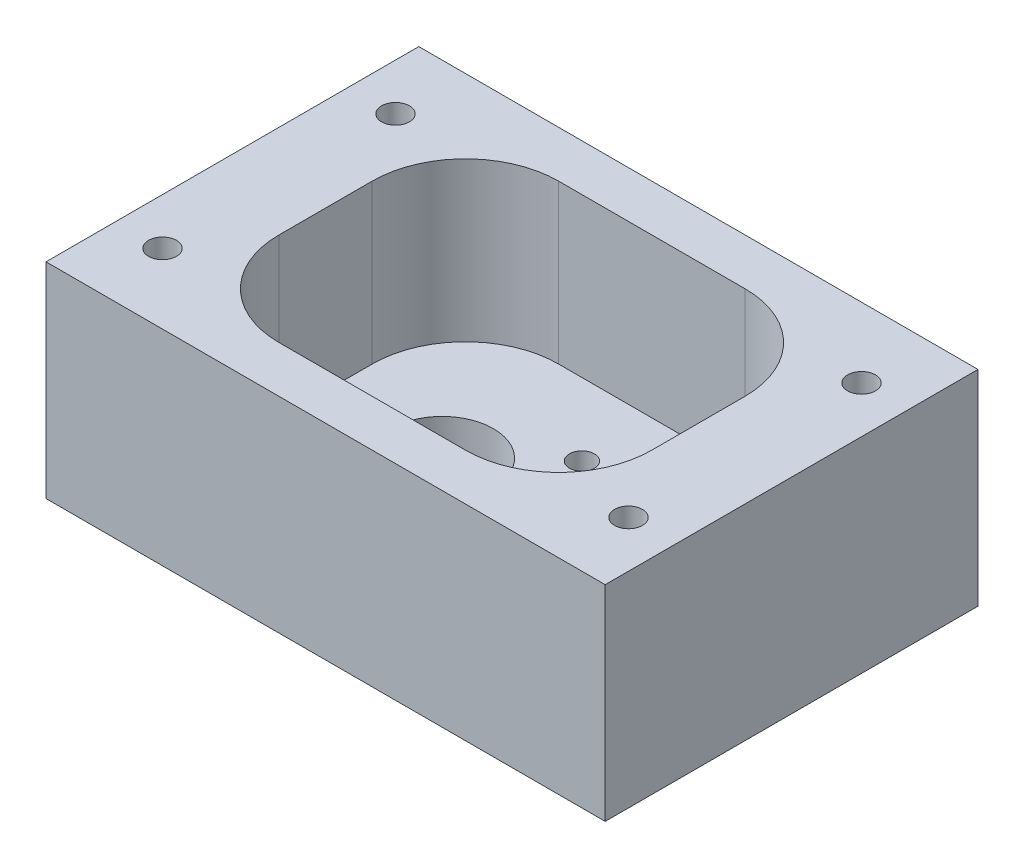
ISO-10303-21;
HEADER;
FILE_DESCRIPTION(('STEP AP214'),'2;1');
FILE_NAME('part.step','',(''),(''),'','','');
FILE_SCHEMA(('AUTOMOTIVE_DESIGN { 1 0 10303 214 1 1 1 1 }'));
ENDSEC;
DATA;
#1=APPLICATION_CONTEXT('core data for automotive mechanical design processes');
#2=APPLICATION_PROTOCOL_DEFINITION('international standard','automotive_design',2000,#1);
#3=PRODUCT_CONTEXT('',#1,'mechanical');
#4=PRODUCT('Part','Part','',(#3));
#5=PRODUCT_RELATED_PRODUCT_CATEGORY('part','',(#4));
#6=PRODUCT_DEFINITION_FORMATION('','',#4);
#7=PRODUCT_DEFINITION_CONTEXT('part definition',#1,'design');
#8=PRODUCT_DEFINITION('design','',#6,#7);
#9=PRODUCT_DEFINITION_SHAPE('','',#8);
#10=(LENGTH_UNIT() NAMED_UNIT(*) SI_UNIT(.MILLI.,.METRE.));
#11=(NAMED_UNIT(*) PLANE_ANGLE_UNIT() SI_UNIT($,.RADIAN.));
#12=(NAMED_UNIT(*) SI_UNIT($,.STERADIAN.) SOLID_ANGLE_UNIT());
#13=UNCERTAINTY_MEASURE_WITH_UNIT(LENGTH_MEASURE(1.E-05),#10,'distance_accuracy_value','');
#14=(GEOMETRIC_REPRESENTATION_CONTEXT(3) GLOBAL_UNCERTAINTY_ASSIGNED_CONTEXT((#13)) GLOBAL_UNIT_ASSIGNED_CONTEXT((#10,
#11,#12)) REPRESENTATION_CONTEXT('',''));
#15=CARTESIAN_POINT('',(0.,0.,0.));
#16=DIRECTION('',(0.,0.,1.));
#17=DIRECTION('',(1.,0.,0.));
#18=AXIS2_PLACEMENT_3D('',#15,#16,#17);
#19=CARTESIAN_POINT('',(38.1,27.94,25.4));
#20=DIRECTION('',(-1.,0.,0.));
#21=DIRECTION('',(0.,0.,1.));
#22=AXIS2_PLACEMENT_3D('',#19,#20,#21);
#23=PLANE('',#22);
#24=DIRECTION('',(0.,0.,-1.));
#25=VECTOR('',#24,1.);
#26=CARTESIAN_POINT('',(38.1,0.,25.4));
#27=LINE('',#26,#25);
#28=CARTESIAN_POINT('',(38.1,0.,25.4));
#29=VERTEX_POINT('',#28);
#30=CARTESIAN_POINT('',(38.1,0.,-25.4));
#31=VERTEX_POINT('',#30);
#32=EDGE_CURVE('E217',#29,#31,#27,.T.);
#33=ORIENTED_EDGE('',*,*,#32,.T.);
#34=DIRECTION('',(0.,-1.,0.));
#35=VECTOR('',#34,1.);
#36=CARTESIAN_POINT('',(38.1,27.94,-25.4));
#37=LINE('',#36,#35);
#38=CARTESIAN_POINT('',(38.1,27.94,-25.4));
#39=VERTEX_POINT('',#38);
#40=EDGE_CURVE('E11',#39,#31,#37,.T.);
#41=ORIENTED_EDGE('',*,*,#40,.F.);
#42=DIRECTION('',(0.,0.,-1.));
#43=VECTOR('',#42,1.);
#44=CARTESIAN_POINT('',(38.1,27.94,25.4));
#45=LINE('',#44,#43);
#46=CARTESIAN_POINT('',(38.1,27.94,25.4));
#47=VERTEX_POINT('',#46);
#48=EDGE_CURVE('E220',#47,#39,#45,.T.);
#49=ORIENTED_EDGE('',*,*,#48,.F.);
#50=DIRECTION('',(0.,-1.,0.));
#51=VECTOR('',#50,1.);
#52=CARTESIAN_POINT('',(38.1,27.94,25.4));
#53=LINE('',#52,#51);
#54=EDGE_CURVE('E226',#47,#29,#53,.T.);
#55=ORIENTED_EDGE('',*,*,#54,.T.);
#56=EDGE_LOOP('',(#33,#41,#49,#55));
#57=FACE_BOUND('',#56,.T.);
#58=ADVANCED_FACE('F35',(#57),#23,.F.);
#59=CARTESIAN_POINT('',(-38.1,27.94,-25.4));
#60=DIRECTION('',(0.,0.,1.));
#61=DIRECTION('',(1.,0.,0.));
#62=AXIS2_PLACEMENT_3D('',#59,#60,#61);
#63=PLANE('',#62);
#64=DIRECTION('',(-1.,0.,0.));
#65=VECTOR('',#64,1.);
#66=CARTESIAN_POINT('',(-38.1,0.,-25.4));
#67=LINE('',#66,#65);
#68=CARTESIAN_POINT('',(-38.1,0.,-25.4));
#69=VERTEX_POINT('',#68);
#70=EDGE_CURVE('E229',#31,#69,#67,.T.);
#71=ORIENTED_EDGE('',*,*,#70,.T.);
#72=DIRECTION('',(0.,-1.,0.));
#73=VECTOR('',#72,1.);
#74=CARTESIAN_POINT('',(-38.1,27.94,-25.4));
#75=LINE('',#74,#73);
#76=CARTESIAN_POINT('',(-38.1,27.94,-25.4));
#77=VERTEX_POINT('',#76);
#78=EDGE_CURVE('E43',#77,#69,#75,.T.);
#79=ORIENTED_EDGE('',*,*,#78,.F.);
#80=DIRECTION('',(-1.,0.,0.));
#81=VECTOR('',#80,1.);
#82=CARTESIAN_POINT('',(-38.1,27.94,-25.4));
#83=LINE('',#82,#81);
#84=EDGE_CURVE('E88',#39,#77,#83,.T.);
#85=ORIENTED_EDGE('',*,*,#84,.F.);
#86=ORIENTED_EDGE('',*,*,#40,.T.);
#87=EDGE_LOOP('',(#71,#79,#85,#86));
#88=FACE_BOUND('',#87,.T.);
#89=ADVANCED_FACE('F322',(#88),#63,.F.);
#90=CARTESIAN_POINT('',(-38.1,27.94,25.4));
#91=DIRECTION('',(1.,0.,0.));
#92=DIRECTION('',(0.,0.,-1.));
#93=AXIS2_PLACEMENT_3D('',#90,#91,#92);
#94=PLANE('',#93);
#95=DIRECTION('',(0.,0.,1.));
#96=VECTOR('',#95,1.);
#97=CARTESIAN_POINT('',(-38.1,0.,25.4));
#98=LINE('',#97,#96);
#99=CARTESIAN_POINT('',(-38.1,0.,25.4));
#100=VERTEX_POINT('',#99);
#101=EDGE_CURVE('E231',#69,#100,#98,.T.);
#102=ORIENTED_EDGE('',*,*,#101,.T.);
#103=DIRECTION('',(0.,-1.,0.));
#104=VECTOR('',#103,1.);
#105=CARTESIAN_POINT('',(-38.1,27.94,25.4));
#106=LINE('',#105,#104);
#107=CARTESIAN_POINT('',(-38.1,27.94,25.4));
#108=VERTEX_POINT('',#107);
#109=EDGE_CURVE('E235',#108,#100,#106,.T.);
#110=ORIENTED_EDGE('',*,*,#109,.F.);
#111=DIRECTION('',(0.,0.,1.));
#112=VECTOR('',#111,1.);
#113=CARTESIAN_POINT('',(-38.1,27.94,25.4));
#114=LINE('',#113,#112);
#115=EDGE_CURVE('E223',#77,#108,#114,.T.);
#116=ORIENTED_EDGE('',*,*,#115,.F.);
#117=ORIENTED_EDGE('',*,*,#78,.T.);
#118=EDGE_LOOP('',(#102,#110,#116,#117));
#119=FACE_BOUND('',#118,.T.);
#120=ADVANCED_FACE('F321',(#119),#94,.F.);
#121=CARTESIAN_POINT('',(-38.1,27.94,25.4));
#122=DIRECTION('',(0.,0.,-1.));
#123=DIRECTION('',(-1.,0.,0.));
#124=AXIS2_PLACEMENT_3D('',#121,#122,#123);
#125=PLANE('',#124);
#126=DIRECTION('',(1.,0.,0.));
#127=VECTOR('',#126,1.);
#128=CARTESIAN_POINT('',(-38.1,0.,25.4));
#129=LINE('',#128,#127);
#130=EDGE_CURVE('E81',#100,#29,#129,.T.);
#131=ORIENTED_EDGE('',*,*,#130,.T.);
#132=ORIENTED_EDGE('',*,*,#54,.F.);
#133=DIRECTION('',(1.,0.,0.));
#134=VECTOR('',#133,1.);
#135=CARTESIAN_POINT('',(-38.1,27.94,25.4));
#136=LINE('',#135,#134);
#137=EDGE_CURVE('E60',#108,#47,#136,.T.);
#138=ORIENTED_EDGE('',*,*,#137,.F.);
#139=ORIENTED_EDGE('',*,*,#109,.T.);
#140=EDGE_LOOP('',(#131,#132,#138,#139));
#141=FACE_BOUND('',#140,.T.);
#142=ADVANCED_FACE('F317',(#141),#125,.F.);
#143=CARTESIAN_POINT('',(0.,27.94,0.));
#144=DIRECTION('',(0.,-1.,0.));
#145=DIRECTION('',(0.,0.,-1.));
#146=AXIS2_PLACEMENT_3D('',#143,#144,#145);
#147=PLANE('',#146);
#148=CARTESIAN_POINT('',(-31.75,27.94,15.875));
#149=DIRECTION('',(0.,-1.,0.));
#150=DIRECTION('',(0.,0.,-1.));
#151=AXIS2_PLACEMENT_3D('',#148,#149,#150);
#152=CIRCLE('',#151,1.89864999999999);
#153=CARTESIAN_POINT('',(-31.75,27.94,13.97635));
#154=VERTEX_POINT('',#153);
#155=EDGE_CURVE('E279',#154,#154,#152,.T.);
#156=ORIENTED_EDGE('',*,*,#155,.T.);
#157=EDGE_LOOP('',(#156));
#158=FACE_BOUND('',#157,.T.);
#159=CARTESIAN_POINT('',(-31.75,27.94,-15.875));
#160=DIRECTION('',(0.,-1.,0.));
#161=DIRECTION('',(0.,0.,-1.));
#162=AXIS2_PLACEMENT_3D('',#159,#160,#161);
#163=CIRCLE('',#162,1.89864999999999);
#164=CARTESIAN_POINT('',(-31.75,27.94,-17.77365));
#165=VERTEX_POINT('',#164);
#166=EDGE_CURVE('E273',#165,#165,#163,.T.);
#167=ORIENTED_EDGE('',*,*,#166,.T.);
#168=EDGE_LOOP('',(#167));
#169=FACE_BOUND('',#168,.T.);
#170=CARTESIAN_POINT('',(31.75,27.94,15.875));
#171=DIRECTION('',(0.,-1.,0.));
#172=DIRECTION('',(0.,0.,-1.));
#173=AXIS2_PLACEMENT_3D('',#170,#171,#172);
#174=CIRCLE('',#173,1.89864999999999);
#175=CARTESIAN_POINT('',(31.75,27.94,13.97635));
#176=VERTEX_POINT('',#175);
#177=EDGE_CURVE('E267',#176,#176,#174,.T.);
#178=ORIENTED_EDGE('',*,*,#177,.T.);
#179=EDGE_LOOP('',(#178));
#180=FACE_BOUND('',#179,.T.);
#181=CARTESIAN_POINT('',(31.75,27.94,-15.875));
#182=DIRECTION('',(0.,-1.,0.));
#183=DIRECTION('',(0.,0.,-1.));
#184=AXIS2_PLACEMENT_3D('',#181,#182,#183);
#185=CIRCLE('',#184,1.89864999999999);
#186=CARTESIAN_POINT('',(31.75,27.94,-17.77365));
#187=VERTEX_POINT('',#186);
#188=EDGE_CURVE('E261',#187,#187,#185,.T.);
#189=ORIENTED_EDGE('',*,*,#188,.T.);
#190=EDGE_LOOP('',(#189));
#191=FACE_BOUND('',#190,.T.);
#192=DIRECTION('',(-1.,0.,0.));
#193=VECTOR('',#192,1.);
#194=CARTESIAN_POINT('',(-12.7,27.94,-19.05));
#195=LINE('',#194,#193);
#196=CARTESIAN_POINT('',(12.7,27.94,-19.05));
#197=VERTEX_POINT('',#196);
#198=CARTESIAN_POINT('',(-12.7,27.94,-19.05));
#199=VERTEX_POINT('',#198);
#200=EDGE_CURVE('E179',#197,#199,#195,.T.);
#201=ORIENTED_EDGE('',*,*,#200,.F.);
#202=CARTESIAN_POINT('',(12.7,27.94,-6.34999999999999));
#203=DIRECTION('',(0.,1.,0.));
#204=DIRECTION('',(0.,0.,-1.));
#205=AXIS2_PLACEMENT_3D('',#202,#203,#204);
#206=CIRCLE('',#205,12.7);
#207=CARTESIAN_POINT('',(25.4,27.94,-6.34999999999999));
#208=VERTEX_POINT('',#207);
#209=EDGE_CURVE('E51',#208,#197,#206,.T.);
#210=ORIENTED_EDGE('',*,*,#209,.F.);
#211=DIRECTION('',(0.,0.,-1.));
#212=VECTOR('',#211,1.);
#213=CARTESIAN_POINT('',(25.4,27.94,6.35000000000001));
#214=LINE('',#213,#212);
#215=CARTESIAN_POINT('',(25.4,27.94,6.35000000000001));
#216=VERTEX_POINT('',#215);
#217=EDGE_CURVE('E156',#216,#208,#214,.T.);
#218=ORIENTED_EDGE('',*,*,#217,.F.);
#219=CARTESIAN_POINT('',(12.7,27.94,6.35000000000001));
#220=DIRECTION('',(0.,1.,0.));
#221=DIRECTION('',(0.,0.,-1.));
#222=AXIS2_PLACEMENT_3D('',#219,#220,#221);
#223=CIRCLE('',#222,12.7);
#224=CARTESIAN_POINT('',(12.7,27.94,19.05));
#225=VERTEX_POINT('',#224);
#226=EDGE_CURVE('E159',#225,#216,#223,.T.);
#227=ORIENTED_EDGE('',*,*,#226,.F.);
#228=DIRECTION('',(1.,0.,0.));
#229=VECTOR('',#228,1.);
#230=CARTESIAN_POINT('',(-12.7,27.94,19.05));
#231=LINE('',#230,#229);
#232=CARTESIAN_POINT('',(-12.7,27.94,19.05));
#233=VERTEX_POINT('',#232);
#234=EDGE_CURVE('E191',#233,#225,#231,.T.);
#235=ORIENTED_EDGE('',*,*,#234,.F.);
#236=CARTESIAN_POINT('',(-12.7,27.94,6.35000000000001));
#237=DIRECTION('',(0.,1.,0.));
#238=DIRECTION('',(0.,0.,-1.));
#239=AXIS2_PLACEMENT_3D('',#236,#237,#238);
#240=CIRCLE('',#239,12.7);
#241=CARTESIAN_POINT('',(-25.4,27.94,6.35000000000001));
#242=VERTEX_POINT('',#241);
#243=EDGE_CURVE('E188',#242,#233,#240,.T.);
#244=ORIENTED_EDGE('',*,*,#243,.F.);
#245=DIRECTION('',(0.,0.,1.));
#246=VECTOR('',#245,1.);
#247=CARTESIAN_POINT('',(-25.4,27.94,6.35000000000001));
#248=LINE('',#247,#246);
#249=CARTESIAN_POINT('',(-25.4,27.94,-6.34999999999999));
#250=VERTEX_POINT('',#249);
#251=EDGE_CURVE('E185',#250,#242,#248,.T.);
#252=ORIENTED_EDGE('',*,*,#251,.F.);
#253=CARTESIAN_POINT('',(-12.7,27.94,-6.34999999999999));
#254=DIRECTION('',(0.,1.,0.));
#255=DIRECTION('',(0.,0.,-1.));
#256=AXIS2_PLACEMENT_3D('',#253,#254,#255);
#257=CIRCLE('',#256,12.7);
#258=EDGE_CURVE('E182',#199,#250,#257,.T.);
#259=ORIENTED_EDGE('',*,*,#258,.F.);
#260=EDGE_LOOP('',(#201,#210,#218,#227,#235,#244,#252,#259));
#261=FACE_BOUND('',#260,.T.);
#262=ORIENTED_EDGE('',*,*,#48,.T.);
#263=ORIENTED_EDGE('',*,*,#84,.T.);
#264=ORIENTED_EDGE('',*,*,#115,.T.);
#265=ORIENTED_EDGE('',*,*,#137,.T.);
#266=EDGE_LOOP('',(#262,#263,#264,#265));
#267=FACE_BOUND('',#266,.T.);
#268=ADVANCED_FACE('F292',(#158,#169,#180,#191,#261,#267),#147,.F.);
#269=CARTESIAN_POINT('',(0.,0.,0.));
#270=DIRECTION('',(0.,-1.,0.));
#271=DIRECTION('',(0.,0.,-1.));
#272=AXIS2_PLACEMENT_3D('',#269,#270,#271);
#273=PLANE('',#272);
#274=CARTESIAN_POINT('',(-31.75,0.,15.875));
#275=DIRECTION('',(0.,-1.,0.));
#276=DIRECTION('',(0.,0.,-1.));
#277=AXIS2_PLACEMENT_3D('',#274,#275,#276);
#278=CIRCLE('',#277,1.89864999999999);
#279=CARTESIAN_POINT('',(-31.75,0.,13.97635));
#280=VERTEX_POINT('',#279);
#281=EDGE_CURVE('E282',#280,#280,#278,.T.);
#282=ORIENTED_EDGE('',*,*,#281,.F.);
#283=EDGE_LOOP('',(#282));
#284=FACE_BOUND('',#283,.T.);
#285=CARTESIAN_POINT('',(-31.75,0.,-15.875));
#286=DIRECTION('',(0.,-1.,0.));
#287=DIRECTION('',(0.,0.,-1.));
#288=AXIS2_PLACEMENT_3D('',#285,#286,#287);
#289=CIRCLE('',#288,1.89864999999999);
#290=CARTESIAN_POINT('',(-31.75,0.,-17.77365));
#291=VERTEX_POINT('',#290);
#292=EDGE_CURVE('E276',#291,#291,#289,.T.);
#293=ORIENTED_EDGE('',*,*,#292,.F.);
#294=EDGE_LOOP('',(#293));
#295=FACE_BOUND('',#294,.T.);
#296=CARTESIAN_POINT('',(31.75,0.,15.875));
#297=DIRECTION('',(0.,-1.,0.));
#298=DIRECTION('',(0.,0.,-1.));
#299=AXIS2_PLACEMENT_3D('',#296,#297,#298);
#300=CIRCLE('',#299,1.89864999999999);
#301=CARTESIAN_POINT('',(31.75,0.,13.97635));
#302=VERTEX_POINT('',#301);
#303=EDGE_CURVE('E270',#302,#302,#300,.T.);
#304=ORIENTED_EDGE('',*,*,#303,.F.);
#305=EDGE_LOOP('',(#304));
#306=FACE_BOUND('',#305,.T.);
#307=CARTESIAN_POINT('',(31.75,0.,-15.875));
#308=DIRECTION('',(0.,-1.,0.));
#309=DIRECTION('',(0.,0.,-1.));
#310=AXIS2_PLACEMENT_3D('',#307,#308,#309);
#311=CIRCLE('',#310,1.89864999999999);
#312=CARTESIAN_POINT('',(31.75,0.,-17.77365));
#313=VERTEX_POINT('',#312);
#314=EDGE_CURVE('E264',#313,#313,#311,.T.);
#315=ORIENTED_EDGE('',*,*,#314,.F.);
#316=EDGE_LOOP('',(#315));
#317=FACE_BOUND('',#316,.T.);
#318=CARTESIAN_POINT('',(0.332611844574898,0.,9.19238815542513));
#319=DIRECTION('',(0.,-1.,0.));
#320=DIRECTION('',(0.,0.,-1.));
#321=AXIS2_PLACEMENT_3D('',#318,#319,#320);
#322=CIRCLE('',#321,1.69999999999999);
#323=CARTESIAN_POINT('',(0.332611844574898,0.,7.49238815542514));
#324=VERTEX_POINT('',#323);
#325=EDGE_CURVE('E257',#324,#324,#322,.T.);
#326=ORIENTED_EDGE('',*,*,#325,.F.);
#327=EDGE_LOOP('',(#326));
#328=FACE_BOUND('',#327,.T.);
#329=CARTESIAN_POINT('',(0.332611844574841,0.,-9.19238815542506));
#330=DIRECTION('',(0.,-1.,0.));
#331=DIRECTION('',(0.,0.,-1.));
#332=AXIS2_PLACEMENT_3D('',#329,#330,#331);
#333=CIRCLE('',#332,1.69999999999999);
#334=CARTESIAN_POINT('',(0.332611844574841,0.,-10.8923881554251));
#335=VERTEX_POINT('',#334);
#336=EDGE_CURVE('E248',#335,#335,#333,.T.);
#337=ORIENTED_EDGE('',*,*,#336,.F.);
#338=EDGE_LOOP('',(#337));
#339=FACE_BOUND('',#338,.T.);
#340=CARTESIAN_POINT('',(18.7173881554252,0.,9.19238815542506));
#341=DIRECTION('',(0.,-1.,0.));
#342=DIRECTION('',(0.,0.,-1.));
#343=AXIS2_PLACEMENT_3D('',#340,#341,#342);
#344=CIRCLE('',#343,1.69999999999999);
#345=CARTESIAN_POINT('',(18.7173881554252,0.,7.49238815542507));
#346=VERTEX_POINT('',#345);
#347=EDGE_CURVE('E245',#346,#346,#344,.T.);
#348=ORIENTED_EDGE('',*,*,#347,.F.);
#349=EDGE_LOOP('',(#348));
#350=FACE_BOUND('',#349,.T.);
#351=CARTESIAN_POINT('',(18.7173881554251,0.,-9.19238815542513));
#352=DIRECTION('',(0.,-1.,0.));
#353=DIRECTION('',(0.,0.,-1.));
#354=AXIS2_PLACEMENT_3D('',#351,#352,#353);
#355=CIRCLE('',#354,1.69999999999999);
#356=CARTESIAN_POINT('',(18.7173881554251,0.,-10.8923881554251));
#357=VERTEX_POINT('',#356);
#358=EDGE_CURVE('E162',#357,#357,#355,.T.);
#359=ORIENTED_EDGE('',*,*,#358,.F.);
#360=EDGE_LOOP('',(#359));
#361=FACE_BOUND('',#360,.T.);
#362=CARTESIAN_POINT('',(-9.525,0.,0.));
#363=DIRECTION('',(0.,-1.,0.));
#364=DIRECTION('',(0.,0.,-1.));
#365=AXIS2_PLACEMENT_3D('',#362,#363,#364);
#366=CIRCLE('',#365,6.985);
#367=CARTESIAN_POINT('',(-9.525,0.,-6.985));
#368=VERTEX_POINT('',#367);
#369=EDGE_CURVE('E214',#368,#368,#366,.T.);
#370=ORIENTED_EDGE('',*,*,#369,.F.);
#371=EDGE_LOOP('',(#370));
#372=FACE_BOUND('',#371,.T.);
#373=CARTESIAN_POINT('',(9.525,0.,0.));
#374=DIRECTION('',(0.,-1.,0.));
#375=DIRECTION('',(0.,0.,-1.));
#376=AXIS2_PLACEMENT_3D('',#373,#374,#375);
#377=CIRCLE('',#376,9.);
#378=CARTESIAN_POINT('',(9.525,0.,-9.));
#379=VERTEX_POINT('',#378);
#380=EDGE_CURVE('E213',#379,#379,#377,.T.);
#381=ORIENTED_EDGE('',*,*,#380,.F.);
#382=EDGE_LOOP('',(#381));
#383=FACE_BOUND('',#382,.T.);
#384=ORIENTED_EDGE('',*,*,#32,.F.);
#385=ORIENTED_EDGE('',*,*,#130,.F.);
#386=ORIENTED_EDGE('',*,*,#101,.F.);
#387=ORIENTED_EDGE('',*,*,#70,.F.);
#388=EDGE_LOOP('',(#384,#385,#386,#387));
#389=FACE_BOUND('',#388,.T.);
#390=ADVANCED_FACE('F288',(#284,#295,#306,#317,#328,#339,#350,#361,#372,#383,#389),#273,.T.);
#391=CARTESIAN_POINT('',(9.525,27.94,0.));
#392=DIRECTION('',(0.,-1.,0.));
#393=DIRECTION('',(0.,0.,-1.));
#394=AXIS2_PLACEMENT_3D('',#391,#392,#393);
#395=CYLINDRICAL_SURFACE('',#394,9.);
#396=CARTESIAN_POINT('',(9.525,6.35,0.));
#397=DIRECTION('',(0.,-1.,0.));
#398=DIRECTION('',(0.,0.,-1.));
#399=AXIS2_PLACEMENT_3D('',#396,#397,#398);
#400=CIRCLE('',#399,9.);
#401=CARTESIAN_POINT('',(9.525,6.35,-9.));
#402=VERTEX_POINT('',#401);
#403=EDGE_CURVE('E210',#402,#402,#400,.F.);
#404=ORIENTED_EDGE('',*,*,#403,.T.);
#405=EDGE_LOOP('',(#404));
#406=FACE_BOUND('',#405,.T.);
#407=ORIENTED_EDGE('',*,*,#380,.T.);
#408=EDGE_LOOP('',(#407));
#409=FACE_BOUND('',#408,.T.);
#410=ADVANCED_FACE('F291',(#406,#409),#395,.F.);
#411=CARTESIAN_POINT('',(-9.525,27.94,0.));
#412=DIRECTION('',(0.,-1.,0.));
#413=DIRECTION('',(0.,0.,-1.));
#414=AXIS2_PLACEMENT_3D('',#411,#412,#413);
#415=CYLINDRICAL_SURFACE('',#414,6.985);
#416=CARTESIAN_POINT('',(-9.525,6.35,0.));
#417=DIRECTION('',(0.,-1.,0.));
#418=DIRECTION('',(0.,0.,-1.));
#419=AXIS2_PLACEMENT_3D('',#416,#417,#418);
#420=CIRCLE('',#419,6.985);
#421=CARTESIAN_POINT('',(-9.525,6.35,-6.985));
#422=VERTEX_POINT('',#421);
#423=EDGE_CURVE('E198',#422,#422,#420,.F.);
#424=ORIENTED_EDGE('',*,*,#423,.T.);
#425=EDGE_LOOP('',(#424));
#426=FACE_BOUND('',#425,.T.);
#427=ORIENTED_EDGE('',*,*,#369,.T.);
#428=EDGE_LOOP('',(#427));
#429=FACE_BOUND('',#428,.T.);
#430=ADVANCED_FACE('F337',(#426,#429),#415,.F.);
#431=CARTESIAN_POINT('',(12.7,6.35,-6.34999999999999));
#432=DIRECTION('',(0.,-1.,0.));
#433=DIRECTION('',(0.,0.,-1.));
#434=AXIS2_PLACEMENT_3D('',#431,#432,#433);
#435=PLANE('',#434);
#436=CARTESIAN_POINT('',(0.332611844574898,6.35,9.19238815542513));
#437=DIRECTION('',(0.,-1.,0.));
#438=DIRECTION('',(0.,0.,-1.));
#439=AXIS2_PLACEMENT_3D('',#436,#437,#438);
#440=CIRCLE('',#439,1.69999999999999);
#441=CARTESIAN_POINT('',(0.332611844574898,6.35,7.49238815542514));
#442=VERTEX_POINT('',#441);
#443=EDGE_CURVE('E38',#442,#442,#440,.T.);
#444=ORIENTED_EDGE('',*,*,#443,.T.);
#445=EDGE_LOOP('',(#444));
#446=FACE_BOUND('',#445,.T.);
#447=CARTESIAN_POINT('',(0.332611844574841,6.35,-9.19238815542506));
#448=DIRECTION('',(0.,-1.,0.));
#449=DIRECTION('',(0.,0.,-1.));
#450=AXIS2_PLACEMENT_3D('',#447,#448,#449);
#451=CIRCLE('',#450,1.69999999999999);
#452=CARTESIAN_POINT('',(0.332611844574841,6.35,-10.8923881554251));
#453=VERTEX_POINT('',#452);
#454=EDGE_CURVE('E246',#453,#453,#451,.T.);
#455=ORIENTED_EDGE('',*,*,#454,.T.);
#456=EDGE_LOOP('',(#455));
#457=FACE_BOUND('',#456,.T.);
#458=CARTESIAN_POINT('',(18.7173881554252,6.35,9.19238815542506));
#459=DIRECTION('',(0.,-1.,0.));
#460=DIRECTION('',(0.,0.,-1.));
#461=AXIS2_PLACEMENT_3D('',#458,#459,#460);
#462=CIRCLE('',#461,1.69999999999999);
#463=CARTESIAN_POINT('',(18.7173881554252,6.35,7.49238815542507));
#464=VERTEX_POINT('',#463);
#465=EDGE_CURVE('E243',#464,#464,#462,.T.);
#466=ORIENTED_EDGE('',*,*,#465,.T.);
#467=EDGE_LOOP('',(#466));
#468=FACE_BOUND('',#467,.T.);
#469=CARTESIAN_POINT('',(18.7173881554251,6.35,-9.19238815542513));
#470=DIRECTION('',(0.,-1.,0.));
#471=DIRECTION('',(0.,0.,-1.));
#472=AXIS2_PLACEMENT_3D('',#469,#470,#471);
#473=CIRCLE('',#472,1.69999999999999);
#474=CARTESIAN_POINT('',(18.7173881554251,6.35,-10.8923881554251));
#475=VERTEX_POINT('',#474);
#476=EDGE_CURVE('E180',#475,#475,#473,.T.);
#477=ORIENTED_EDGE('',*,*,#476,.T.);
#478=EDGE_LOOP('',(#477));
#479=FACE_BOUND('',#478,.T.);
#480=ORIENTED_EDGE('',*,*,#423,.F.);
#481=EDGE_LOOP('',(#480));
#482=FACE_BOUND('',#481,.T.);
#483=CARTESIAN_POINT('',(12.7,6.35,-6.34999999999999));
#484=DIRECTION('',(0.,1.,0.));
#485=DIRECTION('',(0.,0.,-1.));
#486=AXIS2_PLACEMENT_3D('',#483,#484,#485);
#487=CIRCLE('',#486,12.7);
#488=CARTESIAN_POINT('',(25.4,6.35,-6.34999999999999));
#489=VERTEX_POINT('',#488);
#490=CARTESIAN_POINT('',(12.7,6.35,-19.05));
#491=VERTEX_POINT('',#490);
#492=EDGE_CURVE('E136',#489,#491,#487,.T.);
#493=ORIENTED_EDGE('',*,*,#492,.T.);
#494=DIRECTION('',(-1.,0.,0.));
#495=VECTOR('',#494,1.);
#496=CARTESIAN_POINT('',(-12.7,6.35,-19.05));
#497=LINE('',#496,#495);
#498=CARTESIAN_POINT('',(-12.7,6.35,-19.05));
#499=VERTEX_POINT('',#498);
#500=EDGE_CURVE('E145',#491,#499,#497,.T.);
#501=ORIENTED_EDGE('',*,*,#500,.T.);
#502=CARTESIAN_POINT('',(-12.7,6.35,-6.34999999999999));
#503=DIRECTION('',(0.,1.,0.));
#504=DIRECTION('',(0.,0.,-1.));
#505=AXIS2_PLACEMENT_3D('',#502,#503,#504);
#506=CIRCLE('',#505,12.7);
#507=CARTESIAN_POINT('',(-25.4,6.35,-6.34999999999999));
#508=VERTEX_POINT('',#507);
#509=EDGE_CURVE('E150',#499,#508,#506,.T.);
#510=ORIENTED_EDGE('',*,*,#509,.T.);
#511=DIRECTION('',(0.,0.,1.));
#512=VECTOR('',#511,1.);
#513=CARTESIAN_POINT('',(-25.4,6.35,6.35000000000001));
#514=LINE('',#513,#512);
#515=CARTESIAN_POINT('',(-25.4,6.35,6.35000000000001));
#516=VERTEX_POINT('',#515);
#517=EDGE_CURVE('E166',#508,#516,#514,.T.);
#518=ORIENTED_EDGE('',*,*,#517,.T.);
#519=CARTESIAN_POINT('',(-12.7,6.35,6.35000000000001));
#520=DIRECTION('',(0.,1.,0.));
#521=DIRECTION('',(0.,0.,-1.));
#522=AXIS2_PLACEMENT_3D('',#519,#520,#521);
#523=CIRCLE('',#522,12.7);
#524=CARTESIAN_POINT('',(-12.7,6.35,19.05));
#525=VERTEX_POINT('',#524);
#526=EDGE_CURVE('E169',#516,#525,#523,.T.);
#527=ORIENTED_EDGE('',*,*,#526,.T.);
#528=DIRECTION('',(1.,0.,0.));
#529=VECTOR('',#528,1.);
#530=CARTESIAN_POINT('',(-12.7,6.35,19.05));
#531=LINE('',#530,#529);
#532=CARTESIAN_POINT('',(12.7,6.35,19.05));
#533=VERTEX_POINT('',#532);
#534=EDGE_CURVE('E172',#525,#533,#531,.T.);
#535=ORIENTED_EDGE('',*,*,#534,.T.);
#536=CARTESIAN_POINT('',(12.7,6.35,6.35000000000001));
#537=DIRECTION('',(0.,1.,0.));
#538=DIRECTION('',(0.,0.,-1.));
#539=AXIS2_PLACEMENT_3D('',#536,#537,#538);
#540=CIRCLE('',#539,12.7);
#541=CARTESIAN_POINT('',(25.4,6.35,6.35000000000001));
#542=VERTEX_POINT('',#541);
#543=EDGE_CURVE('E175',#533,#542,#540,.T.);
#544=ORIENTED_EDGE('',*,*,#543,.T.);
#545=DIRECTION('',(0.,0.,-1.));
#546=VECTOR('',#545,1.);
#547=CARTESIAN_POINT('',(25.4,6.35,6.35000000000001));
#548=LINE('',#547,#546);
#549=EDGE_CURVE('E142',#542,#489,#548,.T.);
#550=ORIENTED_EDGE('',*,*,#549,.T.);
#551=EDGE_LOOP('',(#493,#501,#510,#518,#527,#535,#544,#550));
#552=FACE_BOUND('',#551,.T.);
#553=ORIENTED_EDGE('',*,*,#403,.F.);
#554=EDGE_LOOP('',(#553));
#555=FACE_BOUND('',#554,.T.);
#556=ADVANCED_FACE('F152',(#446,#457,#468,#479,#482,#552,#555),#435,.F.);
#557=CARTESIAN_POINT('',(12.7,6.35,-6.34999999999999));
#558=DIRECTION('',(0.,1.,0.));
#559=DIRECTION('',(0.,0.,1.));
#560=AXIS2_PLACEMENT_3D('',#557,#558,#559);
#561=CYLINDRICAL_SURFACE('',#560,12.7);
#562=ORIENTED_EDGE('',*,*,#209,.T.);
#563=DIRECTION('',(0.,1.,0.));
#564=VECTOR('',#563,1.);
#565=CARTESIAN_POINT('',(12.7,6.35,-19.05));
#566=LINE('',#565,#564);
#567=EDGE_CURVE('E132',#491,#197,#566,.T.);
#568=ORIENTED_EDGE('',*,*,#567,.F.);
#569=ORIENTED_EDGE('',*,*,#492,.F.);
#570=DIRECTION('',(0.,1.,0.));
#571=VECTOR('',#570,1.);
#572=CARTESIAN_POINT('',(25.4,6.35,-6.34999999999999));
#573=LINE('',#572,#571);
#574=EDGE_CURVE('E196',#489,#208,#573,.T.);
#575=ORIENTED_EDGE('',*,*,#574,.T.);
#576=EDGE_LOOP('',(#562,#568,#569,#575));
#577=FACE_BOUND('',#576,.T.);
#578=ADVANCED_FACE('F134',(#577),#561,.F.);
#579=CARTESIAN_POINT('',(25.4,6.35,6.35000000000001));
#580=DIRECTION('',(1.,0.,0.));
#581=DIRECTION('',(0.,0.,-1.));
#582=AXIS2_PLACEMENT_3D('',#579,#580,#581);
#583=PLANE('',#582);
#584=ORIENTED_EDGE('',*,*,#217,.T.);
#585=ORIENTED_EDGE('',*,*,#574,.F.);
#586=ORIENTED_EDGE('',*,*,#549,.F.);
#587=DIRECTION('',(0.,1.,0.));
#588=VECTOR('',#587,1.);
#589=CARTESIAN_POINT('',(25.4,6.35,6.35000000000001));
#590=LINE('',#589,#588);
#591=EDGE_CURVE('E199',#542,#216,#590,.T.);
#592=ORIENTED_EDGE('',*,*,#591,.T.);
#593=EDGE_LOOP('',(#584,#585,#586,#592));
#594=FACE_BOUND('',#593,.T.);
#595=ADVANCED_FACE('F344',(#594),#583,.F.);
#596=CARTESIAN_POINT('',(12.7,6.35,6.35000000000001));
#597=DIRECTION('',(0.,1.,0.));
#598=DIRECTION('',(0.,0.,1.));
#599=AXIS2_PLACEMENT_3D('',#596,#597,#598);
#600=CYLINDRICAL_SURFACE('',#599,12.7);
#601=ORIENTED_EDGE('',*,*,#226,.T.);
#602=ORIENTED_EDGE('',*,*,#591,.F.);
#603=ORIENTED_EDGE('',*,*,#543,.F.);
#604=DIRECTION('',(0.,1.,0.));
#605=VECTOR('',#604,1.);
#606=CARTESIAN_POINT('',(12.7,6.35,19.05));
#607=LINE('',#606,#605);
#608=EDGE_CURVE('E201',#533,#225,#607,.T.);
#609=ORIENTED_EDGE('',*,*,#608,.T.);
#610=EDGE_LOOP('',(#601,#602,#603,#609));
#611=FACE_BOUND('',#610,.T.);
#612=ADVANCED_FACE('F363',(#611),#600,.F.);
#613=CARTESIAN_POINT('',(-12.7,6.35,19.05));
#614=DIRECTION('',(0.,0.,1.));
#615=DIRECTION('',(1.,0.,0.));
#616=AXIS2_PLACEMENT_3D('',#613,#614,#615);
#617=PLANE('',#616);
#618=ORIENTED_EDGE('',*,*,#234,.T.);
#619=ORIENTED_EDGE('',*,*,#608,.F.);
#620=ORIENTED_EDGE('',*,*,#534,.F.);
#621=DIRECTION('',(0.,1.,0.));
#622=VECTOR('',#621,1.);
#623=CARTESIAN_POINT('',(-12.7,6.35,19.05));
#624=LINE('',#623,#622);
#625=EDGE_CURVE('E203',#525,#233,#624,.T.);
#626=ORIENTED_EDGE('',*,*,#625,.T.);
#627=EDGE_LOOP('',(#618,#619,#620,#626));
#628=FACE_BOUND('',#627,.T.);
#629=ADVANCED_FACE('F359',(#628),#617,.F.);
#630=CARTESIAN_POINT('',(-12.7,6.35,6.35000000000001));
#631=DIRECTION('',(0.,1.,0.));
#632=DIRECTION('',(0.,0.,1.));
#633=AXIS2_PLACEMENT_3D('',#630,#631,#632);
#634=CYLINDRICAL_SURFACE('',#633,12.7);
#635=ORIENTED_EDGE('',*,*,#243,.T.);
#636=ORIENTED_EDGE('',*,*,#625,.F.);
#637=ORIENTED_EDGE('',*,*,#526,.F.);
#638=DIRECTION('',(0.,1.,0.));
#639=VECTOR('',#638,1.);
#640=CARTESIAN_POINT('',(-25.4,6.35,6.35000000000001));
#641=LINE('',#640,#639);
#642=EDGE_CURVE('E205',#516,#242,#641,.T.);
#643=ORIENTED_EDGE('',*,*,#642,.T.);
#644=EDGE_LOOP('',(#635,#636,#637,#643));
#645=FACE_BOUND('',#644,.T.);
#646=ADVANCED_FACE('F355',(#645),#634,.F.);
#647=CARTESIAN_POINT('',(-25.4,6.35,6.35000000000001));
#648=DIRECTION('',(-1.,0.,0.));
#649=DIRECTION('',(0.,0.,1.));
#650=AXIS2_PLACEMENT_3D('',#647,#648,#649);
#651=PLANE('',#650);
#652=ORIENTED_EDGE('',*,*,#251,.T.);
#653=ORIENTED_EDGE('',*,*,#642,.F.);
#654=ORIENTED_EDGE('',*,*,#517,.F.);
#655=DIRECTION('',(0.,1.,0.));
#656=VECTOR('',#655,1.);
#657=CARTESIAN_POINT('',(-25.4,6.35,-6.34999999999999));
#658=LINE('',#657,#656);
#659=EDGE_CURVE('E207',#508,#250,#658,.T.);
#660=ORIENTED_EDGE('',*,*,#659,.T.);
#661=EDGE_LOOP('',(#652,#653,#654,#660));
#662=FACE_BOUND('',#661,.T.);
#663=ADVANCED_FACE('F351',(#662),#651,.F.);
#664=CARTESIAN_POINT('',(-12.7,6.35,-6.34999999999999));
#665=DIRECTION('',(0.,1.,0.));
#666=DIRECTION('',(0.,0.,1.));
#667=AXIS2_PLACEMENT_3D('',#664,#665,#666);
#668=CYLINDRICAL_SURFACE('',#667,12.7);
#669=ORIENTED_EDGE('',*,*,#258,.T.);
#670=ORIENTED_EDGE('',*,*,#659,.F.);
#671=ORIENTED_EDGE('',*,*,#509,.F.);
#672=DIRECTION('',(0.,1.,0.));
#673=VECTOR('',#672,1.);
#674=CARTESIAN_POINT('',(-12.7,6.35,-19.05));
#675=LINE('',#674,#673);
#676=EDGE_CURVE('E141',#499,#199,#675,.T.);
#677=ORIENTED_EDGE('',*,*,#676,.T.);
#678=EDGE_LOOP('',(#669,#670,#671,#677));
#679=FACE_BOUND('',#678,.T.);
#680=ADVANCED_FACE('F348',(#679),#668,.F.);
#681=CARTESIAN_POINT('',(-12.7,6.35,-19.05));
#682=DIRECTION('',(0.,0.,-1.));
#683=DIRECTION('',(-1.,0.,0.));
#684=AXIS2_PLACEMENT_3D('',#681,#682,#683);
#685=PLANE('',#684);
#686=ORIENTED_EDGE('',*,*,#200,.T.);
#687=ORIENTED_EDGE('',*,*,#676,.F.);
#688=ORIENTED_EDGE('',*,*,#500,.F.);
#689=ORIENTED_EDGE('',*,*,#567,.T.);
#690=EDGE_LOOP('',(#686,#687,#688,#689));
#691=FACE_BOUND('',#690,.T.);
#692=ADVANCED_FACE('F146',(#691),#685,.F.);
#693=CARTESIAN_POINT('',(18.7173881554251,0.,-9.19238815542513));
#694=DIRECTION('',(0.,-1.,0.));
#695=DIRECTION('',(0.,0.,-1.));
#696=AXIS2_PLACEMENT_3D('',#693,#694,#695);
#697=CYLINDRICAL_SURFACE('',#696,1.69999999999999);
#698=ORIENTED_EDGE('',*,*,#358,.T.);
#699=EDGE_LOOP('',(#698));
#700=FACE_BOUND('',#699,.T.);
#701=ORIENTED_EDGE('',*,*,#476,.F.);
#702=EDGE_LOOP('',(#701));
#703=FACE_BOUND('',#702,.T.);
#704=ADVANCED_FACE('F347',(#700,#703),#697,.F.);
#705=CARTESIAN_POINT('',(18.7173881554252,0.,9.19238815542506));
#706=DIRECTION('',(0.,-1.,0.));
#707=DIRECTION('',(0.,0.,-1.));
#708=AXIS2_PLACEMENT_3D('',#705,#706,#707);
#709=CYLINDRICAL_SURFACE('',#708,1.69999999999999);
#710=ORIENTED_EDGE('',*,*,#347,.T.);
#711=EDGE_LOOP('',(#710));
#712=FACE_BOUND('',#711,.T.);
#713=ORIENTED_EDGE('',*,*,#465,.F.);
#714=EDGE_LOOP('',(#713));
#715=FACE_BOUND('',#714,.T.);
#716=ADVANCED_FACE('F376',(#712,#715),#709,.F.);
#717=CARTESIAN_POINT('',(0.332611844574841,0.,-9.19238815542506));
#718=DIRECTION('',(0.,-1.,0.));
#719=DIRECTION('',(0.,0.,-1.));
#720=AXIS2_PLACEMENT_3D('',#717,#718,#719);
#721=CYLINDRICAL_SURFACE('',#720,1.69999999999999);
#722=ORIENTED_EDGE('',*,*,#336,.T.);
#723=EDGE_LOOP('',(#722));
#724=FACE_BOUND('',#723,.T.);
#725=ORIENTED_EDGE('',*,*,#454,.F.);
#726=EDGE_LOOP('',(#725));
#727=FACE_BOUND('',#726,.T.);
#728=ADVANCED_FACE('F380',(#724,#727),#721,.F.);
#729=CARTESIAN_POINT('',(0.332611844574898,0.,9.19238815542513));
#730=DIRECTION('',(0.,-1.,0.));
#731=DIRECTION('',(0.,0.,-1.));
#732=AXIS2_PLACEMENT_3D('',#729,#730,#731);
#733=CYLINDRICAL_SURFACE('',#732,1.69999999999999);
#734=ORIENTED_EDGE('',*,*,#325,.T.);
#735=EDGE_LOOP('',(#734));
#736=FACE_BOUND('',#735,.T.);
#737=ORIENTED_EDGE('',*,*,#443,.F.);
#738=EDGE_LOOP('',(#737));
#739=FACE_BOUND('',#738,.T.);
#740=ADVANCED_FACE('F384',(#736,#739),#733,.F.);
#741=CARTESIAN_POINT('',(31.75,0.,-15.875));
#742=DIRECTION('',(0.,-1.,0.));
#743=DIRECTION('',(0.,0.,-1.));
#744=AXIS2_PLACEMENT_3D('',#741,#742,#743);
#745=CYLINDRICAL_SURFACE('',#744,1.89864999999999);
#746=ORIENTED_EDGE('',*,*,#188,.F.);
#747=EDGE_LOOP('',(#746));
#748=FACE_BOUND('',#747,.T.);
#749=ORIENTED_EDGE('',*,*,#314,.T.);
#750=EDGE_LOOP('',(#749));
#751=FACE_BOUND('',#750,.T.);
#752=ADVANCED_FACE('F387',(#748,#751),#745,.F.);
#753=CARTESIAN_POINT('',(31.75,0.,15.875));
#754=DIRECTION('',(0.,-1.,0.));
#755=DIRECTION('',(0.,0.,-1.));
#756=AXIS2_PLACEMENT_3D('',#753,#754,#755);
#757=CYLINDRICAL_SURFACE('',#756,1.89864999999999);
#758=ORIENTED_EDGE('',*,*,#177,.F.);
#759=EDGE_LOOP('',(#758));
#760=FACE_BOUND('',#759,.T.);
#761=ORIENTED_EDGE('',*,*,#303,.T.);
#762=EDGE_LOOP('',(#761));
#763=FACE_BOUND('',#762,.T.);
#764=ADVANCED_FACE('F391',(#760,#763),#757,.F.);
#765=CARTESIAN_POINT('',(-31.75,0.,-15.875));
#766=DIRECTION('',(0.,-1.,0.));
#767=DIRECTION('',(0.,0.,-1.));
#768=AXIS2_PLACEMENT_3D('',#765,#766,#767);
#769=CYLINDRICAL_SURFACE('',#768,1.89864999999999);
#770=ORIENTED_EDGE('',*,*,#166,.F.);
#771=EDGE_LOOP('',(#770));
#772=FACE_BOUND('',#771,.T.);
#773=ORIENTED_EDGE('',*,*,#292,.T.);
#774=EDGE_LOOP('',(#773));
#775=FACE_BOUND('',#774,.T.);
#776=ADVANCED_FACE('F395',(#772,#775),#769,.F.);
#777=CARTESIAN_POINT('',(-31.75,0.,15.875));
#778=DIRECTION('',(0.,-1.,0.));
#779=DIRECTION('',(0.,0.,-1.));
#780=AXIS2_PLACEMENT_3D('',#777,#778,#779);
#781=CYLINDRICAL_SURFACE('',#780,1.89864999999999);
#782=ORIENTED_EDGE('',*,*,#155,.F.);
#783=EDGE_LOOP('',(#782));
#784=FACE_BOUND('',#783,.T.);
#785=ORIENTED_EDGE('',*,*,#281,.T.);
#786=EDGE_LOOP('',(#785));
#787=FACE_BOUND('',#786,.T.);
#788=ADVANCED_FACE('F286',(#784,#787),#781,.F.);
#789=CLOSED_SHELL('',(#58,#89,#120,#142,#268,#390,#410,#430,#556,#578,#595,#612,#629,#646,#663,
#680,#692,#704,#716,#728,#740,#752,#764,#776,#788));
#790=MANIFOLD_SOLID_BREP('B2',#789);
#791=ADVANCED_BREP_SHAPE_REPRESENTATION('',(#18,#790),#14);
#792=SHAPE_DEFINITION_REPRESENTATION(#9,#791);
ENDSEC;
END-ISO-10303-21;
